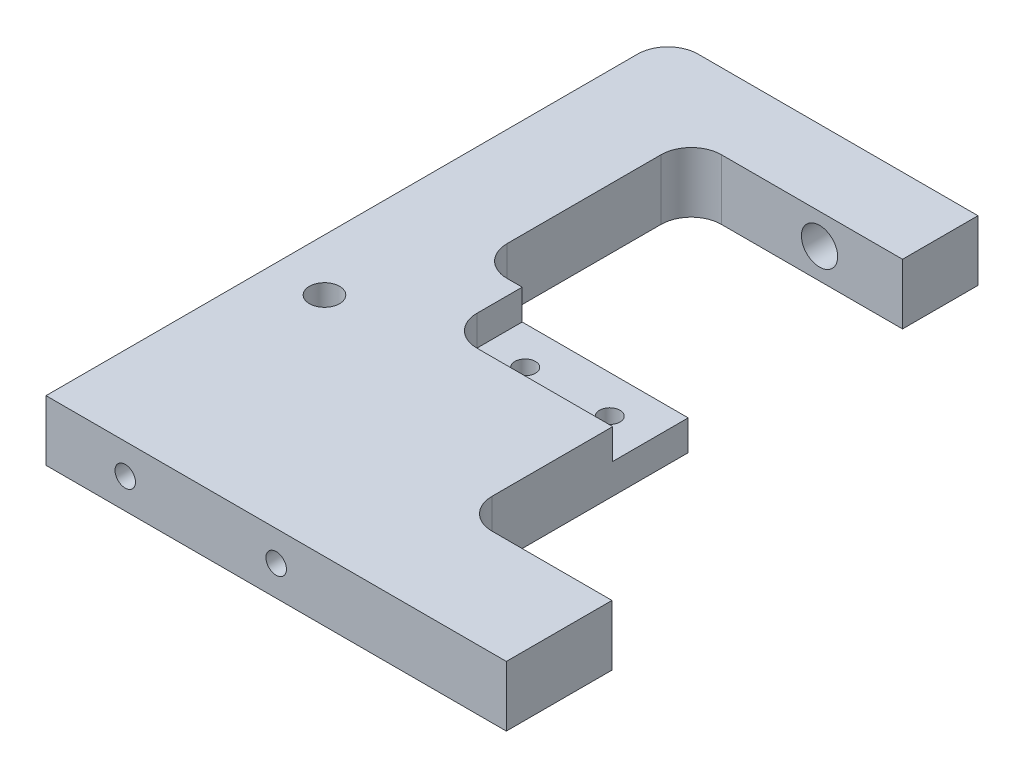
ISO-10303-21;
HEADER;
FILE_DESCRIPTION(('STEP AP214'),'2;1');
FILE_NAME('part.step','',(''),(''),'','','');
FILE_SCHEMA(('AUTOMOTIVE_DESIGN { 1 0 10303 214 1 1 1 1 }'));
ENDSEC;
DATA;
#1=APPLICATION_CONTEXT('core data for automotive mechanical design processes');
#2=APPLICATION_PROTOCOL_DEFINITION('international standard','automotive_design',2000,#1);
#3=PRODUCT_CONTEXT('',#1,'mechanical');
#4=PRODUCT('Part','Part','',(#3));
#5=PRODUCT_RELATED_PRODUCT_CATEGORY('part','',(#4));
#6=PRODUCT_DEFINITION_FORMATION('','',#4);
#7=PRODUCT_DEFINITION_CONTEXT('part definition',#1,'design');
#8=PRODUCT_DEFINITION('design','',#6,#7);
#9=PRODUCT_DEFINITION_SHAPE('','',#8);
#10=(LENGTH_UNIT() NAMED_UNIT(*) SI_UNIT(.MILLI.,.METRE.));
#11=(NAMED_UNIT(*) PLANE_ANGLE_UNIT() SI_UNIT($,.RADIAN.));
#12=(NAMED_UNIT(*) SI_UNIT($,.STERADIAN.) SOLID_ANGLE_UNIT());
#13=UNCERTAINTY_MEASURE_WITH_UNIT(LENGTH_MEASURE(1.E-05),#10,'distance_accuracy_value','');
#14=(GEOMETRIC_REPRESENTATION_CONTEXT(3) GLOBAL_UNCERTAINTY_ASSIGNED_CONTEXT((#13)) GLOBAL_UNIT_ASSIGNED_CONTEXT((#10,
#11,#12)) REPRESENTATION_CONTEXT('',''));
#15=CARTESIAN_POINT('',(0.,0.,0.));
#16=DIRECTION('',(0.,0.,1.));
#17=DIRECTION('',(1.,0.,0.));
#18=AXIS2_PLACEMENT_3D('',#15,#16,#17);
#19=CARTESIAN_POINT('',(10.0000000000001,20.,-206.));
#20=DIRECTION('',(0.,0.,1.));
#21=DIRECTION('',(1.,0.,0.));
#22=AXIS2_PLACEMENT_3D('',#19,#20,#21);
#23=PLANE('',#22);
#24=DIRECTION('',(-1.,0.,0.));
#25=VECTOR('',#24,1.);
#26=CARTESIAN_POINT('',(10.0000000000001,0.,-206.));
#27=LINE('',#26,#25);
#28=CARTESIAN_POINT('',(102.75,0.,-206.));
#29=VERTEX_POINT('',#28);
#30=CARTESIAN_POINT('',(10.0000000000001,0.,-206.));
#31=VERTEX_POINT('',#30);
#32=EDGE_CURVE('E172',#29,#31,#27,.T.);
#33=ORIENTED_EDGE('',*,*,#32,.T.);
#34=DIRECTION('',(0.,-1.,0.));
#35=VECTOR('',#34,1.);
#36=CARTESIAN_POINT('',(10.0000000000001,20.,-206.));
#37=LINE('',#36,#35);
#38=CARTESIAN_POINT('',(10.0000000000001,20.,-206.));
#39=VERTEX_POINT('',#38);
#40=EDGE_CURVE('E169',#39,#31,#37,.T.);
#41=ORIENTED_EDGE('',*,*,#40,.F.);
#42=DIRECTION('',(-1.,0.,0.));
#43=VECTOR('',#42,1.);
#44=CARTESIAN_POINT('',(10.0000000000001,20.,-206.));
#45=LINE('',#44,#43);
#46=CARTESIAN_POINT('',(102.75,20.,-206.));
#47=VERTEX_POINT('',#46);
#48=EDGE_CURVE('E155',#47,#39,#45,.T.);
#49=ORIENTED_EDGE('',*,*,#48,.F.);
#50=DIRECTION('',(0.,-1.,0.));
#51=VECTOR('',#50,1.);
#52=CARTESIAN_POINT('',(102.75,20.,-206.));
#53=LINE('',#52,#51);
#54=EDGE_CURVE('E175',#47,#29,#53,.T.);
#55=ORIENTED_EDGE('',*,*,#54,.T.);
#56=EDGE_LOOP('',(#33,#41,#49,#55));
#57=FACE_BOUND('',#56,.T.);
#58=CARTESIAN_POINT('',(75.25,10.,-206.));
#59=DIRECTION('',(0.,0.,-1.));
#60=DIRECTION('',(-1.,0.,0.));
#61=AXIS2_PLACEMENT_3D('',#58,#59,#60);
#62=CIRCLE('',#61,5.99999999999999);
#63=CARTESIAN_POINT('',(69.25,10.,-206.));
#64=VERTEX_POINT('',#63);
#65=EDGE_CURVE('E471',#64,#64,#62,.T.);
#66=ORIENTED_EDGE('',*,*,#65,.F.);
#67=EDGE_LOOP('',(#66));
#68=FACE_BOUND('',#67,.T.);
#69=ADVANCED_FACE('F40',(#57,#68),#23,.F.);
#70=CARTESIAN_POINT('',(102.75,20.,0.));
#71=DIRECTION('',(0.,0.,-1.));
#72=DIRECTION('',(-1.,0.,0.));
#73=AXIS2_PLACEMENT_3D('',#70,#71,#72);
#74=PLANE('',#73);
#75=CARTESIAN_POINT('',(26.25,10.,0.));
#76=DIRECTION('',(0.,0.,1.));
#77=DIRECTION('',(1.,0.,0.));
#78=AXIS2_PLACEMENT_3D('',#75,#76,#77);
#79=CIRCLE('',#78,3.39999999999999);
#80=CARTESIAN_POINT('',(29.65,10.,0.));
#81=VERTEX_POINT('',#80);
#82=EDGE_CURVE('E266',#81,#81,#79,.T.);
#83=ORIENTED_EDGE('',*,*,#82,.F.);
#84=EDGE_LOOP('',(#83));
#85=FACE_BOUND('',#84,.T.);
#86=CARTESIAN_POINT('',(76.25,10.,0.));
#87=DIRECTION('',(0.,0.,1.));
#88=DIRECTION('',(1.,0.,0.));
#89=AXIS2_PLACEMENT_3D('',#86,#87,#88);
#90=CIRCLE('',#89,3.39999999999999);
#91=CARTESIAN_POINT('',(79.65,10.,0.));
#92=VERTEX_POINT('',#91);
#93=EDGE_CURVE('E272',#92,#92,#90,.T.);
#94=ORIENTED_EDGE('',*,*,#93,.F.);
#95=EDGE_LOOP('',(#94));
#96=FACE_BOUND('',#95,.T.);
#97=DIRECTION('',(1.,0.,0.));
#98=VECTOR('',#97,1.);
#99=CARTESIAN_POINT('',(102.75,0.,0.));
#100=LINE('',#99,#98);
#101=CARTESIAN_POINT('',(0.,0.,0.));
#102=VERTEX_POINT('',#101);
#103=CARTESIAN_POINT('',(152.5,0.,0.));
#104=VERTEX_POINT('',#103);
#105=EDGE_CURVE('E117',#102,#104,#100,.T.);
#106=ORIENTED_EDGE('',*,*,#105,.T.);
#107=DIRECTION('',(0.,-1.,0.));
#108=VECTOR('',#107,1.);
#109=CARTESIAN_POINT('',(152.5,20.,0.));
#110=LINE('',#109,#108);
#111=CARTESIAN_POINT('',(152.5,20.,0.));
#112=VERTEX_POINT('',#111);
#113=EDGE_CURVE('E11',#112,#104,#110,.T.);
#114=ORIENTED_EDGE('',*,*,#113,.F.);
#115=DIRECTION('',(1.,0.,0.));
#116=VECTOR('',#115,1.);
#117=CARTESIAN_POINT('',(102.75,20.,0.));
#118=LINE('',#117,#116);
#119=CARTESIAN_POINT('',(0.,20.,0.));
#120=VERTEX_POINT('',#119);
#121=EDGE_CURVE('E123',#120,#112,#118,.T.);
#122=ORIENTED_EDGE('',*,*,#121,.F.);
#123=DIRECTION('',(0.,-1.,0.));
#124=VECTOR('',#123,1.);
#125=CARTESIAN_POINT('',(0.,20.,0.));
#126=LINE('',#125,#124);
#127=EDGE_CURVE('E181',#120,#102,#126,.T.);
#128=ORIENTED_EDGE('',*,*,#127,.T.);
#129=EDGE_LOOP('',(#106,#114,#122,#128));
#130=FACE_BOUND('',#129,.T.);
#131=ADVANCED_FACE('F42',(#85,#96,#130),#74,.F.);
#132=CARTESIAN_POINT('',(152.5,20.,0.));
#133=DIRECTION('',(-1.,0.,0.));
#134=DIRECTION('',(0.,0.,1.));
#135=AXIS2_PLACEMENT_3D('',#132,#133,#134);
#136=PLANE('',#135);
#137=DIRECTION('',(0.,0.,-1.));
#138=VECTOR('',#137,1.);
#139=CARTESIAN_POINT('',(152.5,0.,0.));
#140=LINE('',#139,#138);
#141=CARTESIAN_POINT('',(152.5,0.,-35.));
#142=VERTEX_POINT('',#141);
#143=EDGE_CURVE('E186',#104,#142,#140,.T.);
#144=ORIENTED_EDGE('',*,*,#143,.T.);
#145=DIRECTION('',(0.,-1.,0.));
#146=VECTOR('',#145,1.);
#147=CARTESIAN_POINT('',(152.5,20.,-35.));
#148=LINE('',#147,#146);
#149=CARTESIAN_POINT('',(152.5,20.,-35.));
#150=VERTEX_POINT('',#149);
#151=EDGE_CURVE('E49',#150,#142,#148,.T.);
#152=ORIENTED_EDGE('',*,*,#151,.F.);
#153=DIRECTION('',(0.,0.,-1.));
#154=VECTOR('',#153,1.);
#155=CARTESIAN_POINT('',(152.5,20.,0.));
#156=LINE('',#155,#154);
#157=EDGE_CURVE('E433',#112,#150,#156,.T.);
#158=ORIENTED_EDGE('',*,*,#157,.F.);
#159=ORIENTED_EDGE('',*,*,#113,.T.);
#160=EDGE_LOOP('',(#144,#152,#158,#159));
#161=FACE_BOUND('',#160,.T.);
#162=ADVANCED_FACE('F345',(#161),#136,.F.);
#163=CARTESIAN_POINT('',(152.5,20.,-35.));
#164=DIRECTION('',(0.,0.,1.));
#165=DIRECTION('',(1.,0.,0.));
#166=AXIS2_PLACEMENT_3D('',#163,#164,#165);
#167=PLANE('',#166);
#168=CARTESIAN_POINT('',(143.5,10.,-35.));
#169=DIRECTION('',(0.,0.,-1.));
#170=DIRECTION('',(-1.,0.,0.));
#171=AXIS2_PLACEMENT_3D('',#168,#169,#170);
#172=CIRCLE('',#171,2.5);
#173=CARTESIAN_POINT('',(141.,10.,-35.));
#174=VERTEX_POINT('',#173);
#175=EDGE_CURVE('E243',#174,#174,#172,.T.);
#176=ORIENTED_EDGE('',*,*,#175,.F.);
#177=EDGE_LOOP('',(#176));
#178=FACE_BOUND('',#177,.T.);
#179=CARTESIAN_POINT('',(131.,10.,-35.));
#180=DIRECTION('',(0.,0.,-1.));
#181=DIRECTION('',(-1.,0.,0.));
#182=AXIS2_PLACEMENT_3D('',#179,#180,#181);
#183=CIRCLE('',#182,2.5);
#184=CARTESIAN_POINT('',(128.5,10.,-35.));
#185=VERTEX_POINT('',#184);
#186=EDGE_CURVE('E260',#185,#185,#183,.T.);
#187=ORIENTED_EDGE('',*,*,#186,.F.);
#188=EDGE_LOOP('',(#187));
#189=FACE_BOUND('',#188,.T.);
#190=DIRECTION('',(-1.,0.,0.));
#191=VECTOR('',#190,1.);
#192=CARTESIAN_POINT('',(152.5,0.,-35.));
#193=LINE('',#192,#191);
#194=CARTESIAN_POINT('',(112.75,0.,-35.));
#195=VERTEX_POINT('',#194);
#196=EDGE_CURVE('E189',#142,#195,#193,.T.);
#197=ORIENTED_EDGE('',*,*,#196,.T.);
#198=DIRECTION('',(0.,-1.,0.));
#199=VECTOR('',#198,1.);
#200=CARTESIAN_POINT('',(112.75,20.,-35.));
#201=LINE('',#200,#199);
#202=CARTESIAN_POINT('',(112.75,20.,-35.));
#203=VERTEX_POINT('',#202);
#204=EDGE_CURVE('E237',#203,#195,#201,.T.);
#205=ORIENTED_EDGE('',*,*,#204,.F.);
#206=DIRECTION('',(-1.,0.,0.));
#207=VECTOR('',#206,1.);
#208=CARTESIAN_POINT('',(152.5,20.,-35.));
#209=LINE('',#208,#207);
#210=EDGE_CURVE('E395',#150,#203,#209,.T.);
#211=ORIENTED_EDGE('',*,*,#210,.F.);
#212=ORIENTED_EDGE('',*,*,#151,.T.);
#213=EDGE_LOOP('',(#197,#205,#211,#212));
#214=FACE_BOUND('',#213,.T.);
#215=ADVANCED_FACE('F381',(#178,#189,#214),#167,.F.);
#216=CARTESIAN_POINT('',(112.75,20.,-45.));
#217=DIRECTION('',(0.,-1.,0.));
#218=DIRECTION('',(0.,0.,-1.));
#219=AXIS2_PLACEMENT_3D('',#216,#217,#218);
#220=CYLINDRICAL_SURFACE('',#219,10.);
#221=CARTESIAN_POINT('',(112.75,0.,-45.));
#222=DIRECTION('',(0.,-1.,0.));
#223=DIRECTION('',(0.,0.,-1.));
#224=AXIS2_PLACEMENT_3D('',#221,#222,#223);
#225=CIRCLE('',#224,10.);
#226=CARTESIAN_POINT('',(102.75,0.,-45.0000000000001));
#227=VERTEX_POINT('',#226);
#228=EDGE_CURVE('E191',#195,#227,#225,.T.);
#229=ORIENTED_EDGE('',*,*,#228,.T.);
#230=DIRECTION('',(0.,-1.,0.));
#231=VECTOR('',#230,1.);
#232=CARTESIAN_POINT('',(102.75,20.,-45.0000000000001));
#233=LINE('',#232,#231);
#234=CARTESIAN_POINT('',(102.75,20.,-45.0000000000001));
#235=VERTEX_POINT('',#234);
#236=EDGE_CURVE('E234',#235,#227,#233,.T.);
#237=ORIENTED_EDGE('',*,*,#236,.F.);
#238=CARTESIAN_POINT('',(112.75,20.,-45.));
#239=DIRECTION('',(0.,-1.,0.));
#240=DIRECTION('',(0.,0.,-1.));
#241=AXIS2_PLACEMENT_3D('',#238,#239,#240);
#242=CIRCLE('',#241,10.);
#243=EDGE_CURVE('E410',#203,#235,#242,.T.);
#244=ORIENTED_EDGE('',*,*,#243,.F.);
#245=ORIENTED_EDGE('',*,*,#204,.T.);
#246=EDGE_LOOP('',(#229,#237,#244,#245));
#247=FACE_BOUND('',#246,.T.);
#248=ADVANCED_FACE('F377',(#247),#220,.F.);
#249=CARTESIAN_POINT('',(102.75,20.,-110.));
#250=DIRECTION('',(-1.,0.,0.));
#251=DIRECTION('',(0.,0.,1.));
#252=AXIS2_PLACEMENT_3D('',#249,#250,#251);
#253=PLANE('',#252);
#254=DIRECTION('',(0.,0.,-1.));
#255=VECTOR('',#254,1.);
#256=CARTESIAN_POINT('',(102.75,10.,-110.));
#257=LINE('',#256,#255);
#258=CARTESIAN_POINT('',(102.75,10.,-85.));
#259=VERTEX_POINT('',#258);
#260=CARTESIAN_POINT('',(102.75,10.,-110.));
#261=VERTEX_POINT('',#260);
#262=EDGE_CURVE('E439',#259,#261,#257,.T.);
#263=ORIENTED_EDGE('',*,*,#262,.F.);
#264=DIRECTION('',(0.,1.,0.));
#265=VECTOR('',#264,1.);
#266=CARTESIAN_POINT('',(102.75,10.,-85.));
#267=LINE('',#266,#265);
#268=CARTESIAN_POINT('',(102.75,20.,-85.));
#269=VERTEX_POINT('',#268);
#270=EDGE_CURVE('E187',#259,#269,#267,.T.);
#271=ORIENTED_EDGE('',*,*,#270,.T.);
#272=DIRECTION('',(0.,0.,-1.));
#273=VECTOR('',#272,1.);
#274=CARTESIAN_POINT('',(102.75,20.,-110.));
#275=LINE('',#274,#273);
#276=EDGE_CURVE('E407',#235,#269,#275,.T.);
#277=ORIENTED_EDGE('',*,*,#276,.F.);
#278=ORIENTED_EDGE('',*,*,#236,.T.);
#279=DIRECTION('',(0.,0.,-1.));
#280=VECTOR('',#279,1.);
#281=CARTESIAN_POINT('',(102.75,0.,-110.));
#282=LINE('',#281,#280);
#283=CARTESIAN_POINT('',(102.75,0.,-110.));
#284=VERTEX_POINT('',#283);
#285=EDGE_CURVE('E193',#227,#284,#282,.T.);
#286=ORIENTED_EDGE('',*,*,#285,.T.);
#287=DIRECTION('',(0.,-1.,0.));
#288=VECTOR('',#287,1.);
#289=CARTESIAN_POINT('',(102.75,20.,-110.));
#290=LINE('',#289,#288);
#291=EDGE_CURVE('E232',#261,#284,#290,.T.);
#292=ORIENTED_EDGE('',*,*,#291,.F.);
#293=EDGE_LOOP('',(#263,#271,#277,#278,#286,#292));
#294=FACE_BOUND('',#293,.T.);
#295=ADVANCED_FACE('F373',(#294),#253,.F.);
#296=CARTESIAN_POINT('',(42.7500000000001,20.,-110.));
#297=DIRECTION('',(0.,0.,1.));
#298=DIRECTION('',(1.,0.,0.));
#299=AXIS2_PLACEMENT_3D('',#296,#297,#298);
#300=PLANE('',#299);
#301=DIRECTION('',(-1.,0.,0.));
#302=VECTOR('',#301,1.);
#303=CARTESIAN_POINT('',(42.7500000000001,20.,-110.));
#304=LINE('',#303,#302);
#305=CARTESIAN_POINT('',(47.75,20.,-110.));
#306=VERTEX_POINT('',#305);
#307=CARTESIAN_POINT('',(42.7500000000001,20.,-110.));
#308=VERTEX_POINT('',#307);
#309=EDGE_CURVE('E409',#306,#308,#304,.T.);
#310=ORIENTED_EDGE('',*,*,#309,.F.);
#311=DIRECTION('',(0.,1.,0.));
#312=VECTOR('',#311,1.);
#313=CARTESIAN_POINT('',(47.75,10.,-110.));
#314=LINE('',#313,#312);
#315=CARTESIAN_POINT('',(47.75,10.,-110.));
#316=VERTEX_POINT('',#315);
#317=EDGE_CURVE('E57',#316,#306,#314,.T.);
#318=ORIENTED_EDGE('',*,*,#317,.F.);
#319=DIRECTION('',(-1.,0.,0.));
#320=VECTOR('',#319,1.);
#321=CARTESIAN_POINT('',(47.75,10.,-110.));
#322=LINE('',#321,#320);
#323=EDGE_CURVE('E449',#261,#316,#322,.T.);
#324=ORIENTED_EDGE('',*,*,#323,.F.);
#325=ORIENTED_EDGE('',*,*,#291,.T.);
#326=DIRECTION('',(-1.,0.,0.));
#327=VECTOR('',#326,1.);
#328=CARTESIAN_POINT('',(42.7500000000001,0.,-110.));
#329=LINE('',#328,#327);
#330=CARTESIAN_POINT('',(42.7500000000001,0.,-110.));
#331=VERTEX_POINT('',#330);
#332=EDGE_CURVE('E196',#284,#331,#329,.T.);
#333=ORIENTED_EDGE('',*,*,#332,.T.);
#334=DIRECTION('',(0.,-1.,0.));
#335=VECTOR('',#334,1.);
#336=CARTESIAN_POINT('',(42.7500000000001,20.,-110.));
#337=LINE('',#336,#335);
#338=EDGE_CURVE('E229',#308,#331,#337,.T.);
#339=ORIENTED_EDGE('',*,*,#338,.F.);
#340=EDGE_LOOP('',(#310,#318,#324,#325,#333,#339));
#341=FACE_BOUND('',#340,.T.);
#342=ADVANCED_FACE('F369',(#341),#300,.F.);
#343=CARTESIAN_POINT('',(42.75,20.,-120.));
#344=DIRECTION('',(0.,-1.,0.));
#345=DIRECTION('',(0.,0.,-1.));
#346=AXIS2_PLACEMENT_3D('',#343,#344,#345);
#347=CYLINDRICAL_SURFACE('',#346,10.);
#348=CARTESIAN_POINT('',(42.75,0.,-120.));
#349=DIRECTION('',(0.,-1.,0.));
#350=DIRECTION('',(0.,0.,1.));
#351=AXIS2_PLACEMENT_3D('',#348,#349,#350);
#352=CIRCLE('',#351,10.);
#353=CARTESIAN_POINT('',(32.75,0.,-120.));
#354=VERTEX_POINT('',#353);
#355=EDGE_CURVE('E198',#331,#354,#352,.T.);
#356=ORIENTED_EDGE('',*,*,#355,.T.);
#357=DIRECTION('',(0.,-1.,0.));
#358=VECTOR('',#357,1.);
#359=CARTESIAN_POINT('',(32.75,20.,-120.));
#360=LINE('',#359,#358);
#361=CARTESIAN_POINT('',(32.75,20.,-120.));
#362=VERTEX_POINT('',#361);
#363=EDGE_CURVE('E226',#362,#354,#360,.T.);
#364=ORIENTED_EDGE('',*,*,#363,.F.);
#365=CARTESIAN_POINT('',(42.75,20.,-120.));
#366=DIRECTION('',(0.,-1.,0.));
#367=DIRECTION('',(0.,0.,1.));
#368=AXIS2_PLACEMENT_3D('',#365,#366,#367);
#369=CIRCLE('',#368,10.);
#370=EDGE_CURVE('E412',#308,#362,#369,.T.);
#371=ORIENTED_EDGE('',*,*,#370,.F.);
#372=ORIENTED_EDGE('',*,*,#338,.T.);
#373=EDGE_LOOP('',(#356,#364,#371,#372));
#374=FACE_BOUND('',#373,.T.);
#375=ADVANCED_FACE('F365',(#374),#347,.F.);
#376=CARTESIAN_POINT('',(32.75,20.,-171.));
#377=DIRECTION('',(-1.,0.,0.));
#378=DIRECTION('',(0.,0.,1.));
#379=AXIS2_PLACEMENT_3D('',#376,#377,#378);
#380=PLANE('',#379);
#381=DIRECTION('',(0.,0.,-1.));
#382=VECTOR('',#381,1.);
#383=CARTESIAN_POINT('',(32.75,0.,-171.));
#384=LINE('',#383,#382);
#385=CARTESIAN_POINT('',(32.75,0.,-171.));
#386=VERTEX_POINT('',#385);
#387=EDGE_CURVE('E200',#354,#386,#384,.T.);
#388=ORIENTED_EDGE('',*,*,#387,.T.);
#389=DIRECTION('',(0.,-1.,0.));
#390=VECTOR('',#389,1.);
#391=CARTESIAN_POINT('',(32.75,20.,-171.));
#392=LINE('',#391,#390);
#393=CARTESIAN_POINT('',(32.75,20.,-171.));
#394=VERTEX_POINT('',#393);
#395=EDGE_CURVE('E223',#394,#386,#392,.T.);
#396=ORIENTED_EDGE('',*,*,#395,.F.);
#397=DIRECTION('',(0.,0.,-1.));
#398=VECTOR('',#397,1.);
#399=CARTESIAN_POINT('',(32.75,20.,-171.));
#400=LINE('',#399,#398);
#401=EDGE_CURVE('E418',#362,#394,#400,.T.);
#402=ORIENTED_EDGE('',*,*,#401,.F.);
#403=ORIENTED_EDGE('',*,*,#363,.T.);
#404=EDGE_LOOP('',(#388,#396,#402,#403));
#405=FACE_BOUND('',#404,.T.);
#406=ADVANCED_FACE('F361',(#405),#380,.F.);
#407=CARTESIAN_POINT('',(42.75,20.,-171.));
#408=DIRECTION('',(0.,-1.,0.));
#409=DIRECTION('',(0.,0.,-1.));
#410=AXIS2_PLACEMENT_3D('',#407,#408,#409);
#411=CYLINDRICAL_SURFACE('',#410,10.);
#412=CARTESIAN_POINT('',(42.75,0.,-171.));
#413=DIRECTION('',(0.,-1.,0.));
#414=DIRECTION('',(0.,0.,1.));
#415=AXIS2_PLACEMENT_3D('',#412,#413,#414);
#416=CIRCLE('',#415,10.);
#417=CARTESIAN_POINT('',(42.75,0.,-181.));
#418=VERTEX_POINT('',#417);
#419=EDGE_CURVE('E202',#386,#418,#416,.T.);
#420=ORIENTED_EDGE('',*,*,#419,.T.);
#421=DIRECTION('',(0.,-1.,0.));
#422=VECTOR('',#421,1.);
#423=CARTESIAN_POINT('',(42.75,20.,-181.));
#424=LINE('',#423,#422);
#425=CARTESIAN_POINT('',(42.75,20.,-181.));
#426=VERTEX_POINT('',#425);
#427=EDGE_CURVE('E220',#426,#418,#424,.T.);
#428=ORIENTED_EDGE('',*,*,#427,.F.);
#429=CARTESIAN_POINT('',(42.75,20.,-171.));
#430=DIRECTION('',(0.,-1.,0.));
#431=DIRECTION('',(0.,0.,1.));
#432=AXIS2_PLACEMENT_3D('',#429,#430,#431);
#433=CIRCLE('',#432,10.);
#434=EDGE_CURVE('E420',#394,#426,#433,.T.);
#435=ORIENTED_EDGE('',*,*,#434,.F.);
#436=ORIENTED_EDGE('',*,*,#395,.T.);
#437=EDGE_LOOP('',(#420,#428,#435,#436));
#438=FACE_BOUND('',#437,.T.);
#439=ADVANCED_FACE('F357',(#438),#411,.F.);
#440=CARTESIAN_POINT('',(102.75,20.,-181.));
#441=DIRECTION('',(0.,0.,-1.));
#442=DIRECTION('',(-1.,0.,0.));
#443=AXIS2_PLACEMENT_3D('',#440,#441,#442);
#444=PLANE('',#443);
#445=CARTESIAN_POINT('',(75.25,10.,-181.));
#446=DIRECTION('',(0.,0.,-1.));
#447=DIRECTION('',(-1.,0.,0.));
#448=AXIS2_PLACEMENT_3D('',#445,#446,#447);
#449=CIRCLE('',#448,5.99999999999999);
#450=CARTESIAN_POINT('',(69.25,10.,-181.));
#451=VERTEX_POINT('',#450);
#452=EDGE_CURVE('E455',#451,#451,#449,.T.);
#453=ORIENTED_EDGE('',*,*,#452,.T.);
#454=EDGE_LOOP('',(#453));
#455=FACE_BOUND('',#454,.T.);
#456=DIRECTION('',(1.,0.,0.));
#457=VECTOR('',#456,1.);
#458=CARTESIAN_POINT('',(102.75,0.,-181.));
#459=LINE('',#458,#457);
#460=CARTESIAN_POINT('',(102.75,0.,-181.));
#461=VERTEX_POINT('',#460);
#462=EDGE_CURVE('E204',#418,#461,#459,.T.);
#463=ORIENTED_EDGE('',*,*,#462,.T.);
#464=DIRECTION('',(0.,-1.,0.));
#465=VECTOR('',#464,1.);
#466=CARTESIAN_POINT('',(102.75,20.,-181.));
#467=LINE('',#466,#465);
#468=CARTESIAN_POINT('',(102.75,20.,-181.));
#469=VERTEX_POINT('',#468);
#470=EDGE_CURVE('E217',#469,#461,#467,.T.);
#471=ORIENTED_EDGE('',*,*,#470,.F.);
#472=DIRECTION('',(1.,0.,0.));
#473=VECTOR('',#472,1.);
#474=CARTESIAN_POINT('',(102.75,20.,-181.));
#475=LINE('',#474,#473);
#476=EDGE_CURVE('E422',#426,#469,#475,.T.);
#477=ORIENTED_EDGE('',*,*,#476,.F.);
#478=ORIENTED_EDGE('',*,*,#427,.T.);
#479=EDGE_LOOP('',(#463,#471,#477,#478));
#480=FACE_BOUND('',#479,.T.);
#481=ADVANCED_FACE('F353',(#455,#480),#444,.F.);
#482=CARTESIAN_POINT('',(102.75,20.,-206.));
#483=DIRECTION('',(-1.,0.,0.));
#484=DIRECTION('',(0.,0.,1.));
#485=AXIS2_PLACEMENT_3D('',#482,#483,#484);
#486=PLANE('',#485);
#487=DIRECTION('',(0.,0.,-1.));
#488=VECTOR('',#487,1.);
#489=CARTESIAN_POINT('',(102.75,0.,-206.));
#490=LINE('',#489,#488);
#491=EDGE_CURVE('E206',#461,#29,#490,.T.);
#492=ORIENTED_EDGE('',*,*,#491,.T.);
#493=ORIENTED_EDGE('',*,*,#54,.F.);
#494=DIRECTION('',(0.,0.,-1.));
#495=VECTOR('',#494,1.);
#496=CARTESIAN_POINT('',(102.75,20.,-206.));
#497=LINE('',#496,#495);
#498=EDGE_CURVE('E163',#469,#47,#497,.T.);
#499=ORIENTED_EDGE('',*,*,#498,.F.);
#500=ORIENTED_EDGE('',*,*,#470,.T.);
#501=EDGE_LOOP('',(#492,#493,#499,#500));
#502=FACE_BOUND('',#501,.T.);
#503=ADVANCED_FACE('F350',(#502),#486,.F.);
#504=CARTESIAN_POINT('',(10.,20.,-196.));
#505=DIRECTION('',(0.,-1.,0.));
#506=DIRECTION('',(0.,0.,-1.));
#507=AXIS2_PLACEMENT_3D('',#504,#505,#506);
#508=CYLINDRICAL_SURFACE('',#507,10.);
#509=CARTESIAN_POINT('',(10.,0.,-196.));
#510=DIRECTION('',(0.,1.,0.));
#511=DIRECTION('',(0.,0.,1.));
#512=AXIS2_PLACEMENT_3D('',#509,#510,#511);
#513=CIRCLE('',#512,10.);
#514=CARTESIAN_POINT('',(0.,0.,-196.));
#515=VERTEX_POINT('',#514);
#516=EDGE_CURVE('E209',#31,#515,#513,.T.);
#517=ORIENTED_EDGE('',*,*,#516,.T.);
#518=DIRECTION('',(0.,-1.,0.));
#519=VECTOR('',#518,1.);
#520=CARTESIAN_POINT('',(0.,20.,-196.));
#521=LINE('',#520,#519);
#522=CARTESIAN_POINT('',(0.,20.,-196.));
#523=VERTEX_POINT('',#522);
#524=EDGE_CURVE('E176',#523,#515,#521,.T.);
#525=ORIENTED_EDGE('',*,*,#524,.F.);
#526=CARTESIAN_POINT('',(10.,20.,-196.));
#527=DIRECTION('',(0.,1.,0.));
#528=DIRECTION('',(0.,0.,1.));
#529=AXIS2_PLACEMENT_3D('',#526,#527,#528);
#530=CIRCLE('',#529,10.);
#531=EDGE_CURVE('E160',#39,#523,#530,.T.);
#532=ORIENTED_EDGE('',*,*,#531,.F.);
#533=ORIENTED_EDGE('',*,*,#40,.T.);
#534=EDGE_LOOP('',(#517,#525,#532,#533));
#535=FACE_BOUND('',#534,.T.);
#536=ADVANCED_FACE('F178',(#535),#508,.T.);
#537=CARTESIAN_POINT('',(0.,20.,0.));
#538=DIRECTION('',(1.,0.,0.));
#539=DIRECTION('',(0.,0.,-1.));
#540=AXIS2_PLACEMENT_3D('',#537,#538,#539);
#541=PLANE('',#540);
#542=CARTESIAN_POINT('',(0.,9.99999999999999,-75.));
#543=DIRECTION('',(-1.,0.,0.));
#544=DIRECTION('',(0.,0.,1.));
#545=AXIS2_PLACEMENT_3D('',#542,#543,#544);
#546=CIRCLE('',#545,2.49999999999999);
#547=CARTESIAN_POINT('',(0.,9.99999999999999,-72.5));
#548=VERTEX_POINT('',#547);
#549=EDGE_CURVE('E278',#548,#548,#546,.T.);
#550=ORIENTED_EDGE('',*,*,#549,.F.);
#551=EDGE_LOOP('',(#550));
#552=FACE_BOUND('',#551,.T.);
#553=DIRECTION('',(0.,0.,1.));
#554=VECTOR('',#553,1.);
#555=CARTESIAN_POINT('',(0.,0.,0.));
#556=LINE('',#555,#554);
#557=EDGE_CURVE('E211',#515,#102,#556,.T.);
#558=ORIENTED_EDGE('',*,*,#557,.T.);
#559=ORIENTED_EDGE('',*,*,#127,.F.);
#560=DIRECTION('',(0.,0.,1.));
#561=VECTOR('',#560,1.);
#562=CARTESIAN_POINT('',(0.,20.,0.));
#563=LINE('',#562,#561);
#564=EDGE_CURVE('E66',#523,#120,#563,.T.);
#565=ORIENTED_EDGE('',*,*,#564,.F.);
#566=ORIENTED_EDGE('',*,*,#524,.T.);
#567=EDGE_LOOP('',(#558,#559,#565,#566));
#568=FACE_BOUND('',#567,.T.);
#569=ADVANCED_FACE('F431',(#552,#568),#541,.F.);
#570=CARTESIAN_POINT('',(10.,20.,-196.));
#571=DIRECTION('',(0.,1.,0.));
#572=DIRECTION('',(0.,0.,1.));
#573=AXIS2_PLACEMENT_3D('',#570,#571,#572);
#574=PLANE('',#573);
#575=CARTESIAN_POINT('',(17.2499999999999,20.,-75.));
#576=DIRECTION('',(0.,1.,0.));
#577=DIRECTION('',(0.,0.,1.));
#578=AXIS2_PLACEMENT_3D('',#575,#576,#577);
#579=CIRCLE('',#578,4.99999999999999);
#580=CARTESIAN_POINT('',(17.2499999999999,20.,-70.));
#581=VERTEX_POINT('',#580);
#582=EDGE_CURVE('E288',#581,#581,#579,.T.);
#583=ORIENTED_EDGE('',*,*,#582,.F.);
#584=EDGE_LOOP('',(#583));
#585=FACE_BOUND('',#584,.T.);
#586=DIRECTION('',(1.,0.,0.));
#587=VECTOR('',#586,1.);
#588=CARTESIAN_POINT('',(57.75,20.,-85.));
#589=LINE('',#588,#587);
#590=CARTESIAN_POINT('',(57.75,20.,-85.));
#591=VERTEX_POINT('',#590);
#592=EDGE_CURVE('E446',#591,#269,#589,.T.);
#593=ORIENTED_EDGE('',*,*,#592,.F.);
#594=CARTESIAN_POINT('',(57.75,20.,-95.));
#595=DIRECTION('',(0.,1.,0.));
#596=DIRECTION('',(0.,0.,1.));
#597=AXIS2_PLACEMENT_3D('',#594,#595,#596);
#598=CIRCLE('',#597,10.);
#599=CARTESIAN_POINT('',(47.75,20.,-95.));
#600=VERTEX_POINT('',#599);
#601=EDGE_CURVE('E450',#600,#591,#598,.T.);
#602=ORIENTED_EDGE('',*,*,#601,.F.);
#603=DIRECTION('',(0.,0.,1.));
#604=VECTOR('',#603,1.);
#605=CARTESIAN_POINT('',(47.75,20.,-110.));
#606=LINE('',#605,#604);
#607=EDGE_CURVE('E453',#306,#600,#606,.T.);
#608=ORIENTED_EDGE('',*,*,#607,.F.);
#609=ORIENTED_EDGE('',*,*,#309,.T.);
#610=ORIENTED_EDGE('',*,*,#370,.T.);
#611=ORIENTED_EDGE('',*,*,#401,.T.);
#612=ORIENTED_EDGE('',*,*,#434,.T.);
#613=ORIENTED_EDGE('',*,*,#476,.T.);
#614=ORIENTED_EDGE('',*,*,#498,.T.);
#615=ORIENTED_EDGE('',*,*,#48,.T.);
#616=ORIENTED_EDGE('',*,*,#531,.T.);
#617=ORIENTED_EDGE('',*,*,#564,.T.);
#618=ORIENTED_EDGE('',*,*,#121,.T.);
#619=ORIENTED_EDGE('',*,*,#157,.T.);
#620=ORIENTED_EDGE('',*,*,#210,.T.);
#621=ORIENTED_EDGE('',*,*,#243,.T.);
#622=ORIENTED_EDGE('',*,*,#276,.T.);
#623=EDGE_LOOP('',(#593,#602,#608,#609,#610,#611,#612,#613,#614,#615,#616,#617,#618,#619,#620,
#621,#622));
#624=FACE_BOUND('',#623,.T.);
#625=ADVANCED_FACE('F158',(#585,#624),#574,.T.);
#626=CARTESIAN_POINT('',(10.,0.,-196.));
#627=DIRECTION('',(0.,1.,0.));
#628=DIRECTION('',(0.,0.,1.));
#629=AXIS2_PLACEMENT_3D('',#626,#627,#628);
#630=PLANE('',#629);
#631=CARTESIAN_POINT('',(61.25,0.,-97.5));
#632=DIRECTION('',(0.,1.,0.));
#633=DIRECTION('',(0.,0.,1.));
#634=AXIS2_PLACEMENT_3D('',#631,#632,#633);
#635=CIRCLE('',#634,3.39999999999999);
#636=CARTESIAN_POINT('',(61.25,0.,-94.1));
#637=VERTEX_POINT('',#636);
#638=EDGE_CURVE('E44',#637,#637,#635,.T.);
#639=ORIENTED_EDGE('',*,*,#638,.T.);
#640=EDGE_LOOP('',(#639));
#641=FACE_BOUND('',#640,.T.);
#642=CARTESIAN_POINT('',(89.25,0.,-97.5));
#643=DIRECTION('',(0.,1.,0.));
#644=DIRECTION('',(0.,0.,1.));
#645=AXIS2_PLACEMENT_3D('',#642,#643,#644);
#646=CIRCLE('',#645,3.4);
#647=CARTESIAN_POINT('',(89.25,0.,-94.1));
#648=VERTEX_POINT('',#647);
#649=EDGE_CURVE('E241',#648,#648,#646,.T.);
#650=ORIENTED_EDGE('',*,*,#649,.T.);
#651=EDGE_LOOP('',(#650));
#652=FACE_BOUND('',#651,.T.);
#653=CARTESIAN_POINT('',(17.2499999999999,0.,-75.));
#654=DIRECTION('',(0.,1.,0.));
#655=DIRECTION('',(0.,0.,1.));
#656=AXIS2_PLACEMENT_3D('',#653,#654,#655);
#657=CIRCLE('',#656,4.99999999999999);
#658=CARTESIAN_POINT('',(17.2499999999999,0.,-70.));
#659=VERTEX_POINT('',#658);
#660=EDGE_CURVE('E473',#659,#659,#657,.T.);
#661=ORIENTED_EDGE('',*,*,#660,.T.);
#662=EDGE_LOOP('',(#661));
#663=FACE_BOUND('',#662,.T.);
#664=ORIENTED_EDGE('',*,*,#105,.F.);
#665=ORIENTED_EDGE('',*,*,#557,.F.);
#666=ORIENTED_EDGE('',*,*,#516,.F.);
#667=ORIENTED_EDGE('',*,*,#32,.F.);
#668=ORIENTED_EDGE('',*,*,#491,.F.);
#669=ORIENTED_EDGE('',*,*,#462,.F.);
#670=ORIENTED_EDGE('',*,*,#419,.F.);
#671=ORIENTED_EDGE('',*,*,#387,.F.);
#672=ORIENTED_EDGE('',*,*,#355,.F.);
#673=ORIENTED_EDGE('',*,*,#332,.F.);
#674=ORIENTED_EDGE('',*,*,#285,.F.);
#675=ORIENTED_EDGE('',*,*,#228,.F.);
#676=ORIENTED_EDGE('',*,*,#196,.F.);
#677=ORIENTED_EDGE('',*,*,#143,.F.);
#678=EDGE_LOOP('',(#664,#665,#666,#667,#668,#669,#670,#671,#672,#673,#674,#675,#676,#677));
#679=FACE_BOUND('',#678,.T.);
#680=ADVANCED_FACE('F397',(#641,#652,#663,#679),#630,.F.);
#681=CARTESIAN_POINT('',(57.75,10.,-85.));
#682=DIRECTION('',(0.,0.,1.));
#683=DIRECTION('',(1.,0.,0.));
#684=AXIS2_PLACEMENT_3D('',#681,#682,#683);
#685=PLANE('',#684);
#686=ORIENTED_EDGE('',*,*,#592,.T.);
#687=ORIENTED_EDGE('',*,*,#270,.F.);
#688=DIRECTION('',(1.,0.,0.));
#689=VECTOR('',#688,1.);
#690=CARTESIAN_POINT('',(57.75,10.,-85.));
#691=LINE('',#690,#689);
#692=CARTESIAN_POINT('',(57.75,10.,-85.));
#693=VERTEX_POINT('',#692);
#694=EDGE_CURVE('E458',#693,#259,#691,.T.);
#695=ORIENTED_EDGE('',*,*,#694,.F.);
#696=DIRECTION('',(0.,1.,0.));
#697=VECTOR('',#696,1.);
#698=CARTESIAN_POINT('',(57.75,10.,-85.));
#699=LINE('',#698,#697);
#700=EDGE_CURVE('E442',#693,#591,#699,.T.);
#701=ORIENTED_EDGE('',*,*,#700,.T.);
#702=EDGE_LOOP('',(#686,#687,#695,#701));
#703=FACE_BOUND('',#702,.T.);
#704=ADVANCED_FACE('F487',(#703),#685,.F.);
#705=CARTESIAN_POINT('',(57.75,10.,-95.));
#706=DIRECTION('',(0.,1.,0.));
#707=DIRECTION('',(0.,0.,1.));
#708=AXIS2_PLACEMENT_3D('',#705,#706,#707);
#709=CYLINDRICAL_SURFACE('',#708,10.);
#710=ORIENTED_EDGE('',*,*,#601,.T.);
#711=ORIENTED_EDGE('',*,*,#700,.F.);
#712=CARTESIAN_POINT('',(57.75,10.,-95.));
#713=DIRECTION('',(0.,1.,0.));
#714=DIRECTION('',(0.,0.,1.));
#715=AXIS2_PLACEMENT_3D('',#712,#713,#714);
#716=CIRCLE('',#715,10.);
#717=CARTESIAN_POINT('',(47.75,10.,-95.));
#718=VERTEX_POINT('',#717);
#719=EDGE_CURVE('E461',#718,#693,#716,.T.);
#720=ORIENTED_EDGE('',*,*,#719,.F.);
#721=DIRECTION('',(0.,1.,0.));
#722=VECTOR('',#721,1.);
#723=CARTESIAN_POINT('',(47.75,10.,-95.));
#724=LINE('',#723,#722);
#725=EDGE_CURVE('E438',#718,#600,#724,.T.);
#726=ORIENTED_EDGE('',*,*,#725,.T.);
#727=EDGE_LOOP('',(#710,#711,#720,#726));
#728=FACE_BOUND('',#727,.T.);
#729=ADVANCED_FACE('F496',(#728),#709,.F.);
#730=CARTESIAN_POINT('',(47.75,10.,-110.));
#731=DIRECTION('',(-1.,0.,0.));
#732=DIRECTION('',(0.,0.,1.));
#733=AXIS2_PLACEMENT_3D('',#730,#731,#732);
#734=PLANE('',#733);
#735=ORIENTED_EDGE('',*,*,#607,.T.);
#736=ORIENTED_EDGE('',*,*,#725,.F.);
#737=DIRECTION('',(0.,0.,1.));
#738=VECTOR('',#737,1.);
#739=CARTESIAN_POINT('',(47.75,10.,-110.));
#740=LINE('',#739,#738);
#741=EDGE_CURVE('E464',#316,#718,#740,.T.);
#742=ORIENTED_EDGE('',*,*,#741,.F.);
#743=ORIENTED_EDGE('',*,*,#317,.T.);
#744=EDGE_LOOP('',(#735,#736,#742,#743));
#745=FACE_BOUND('',#744,.T.);
#746=ADVANCED_FACE('F492',(#745),#734,.F.);
#747=CARTESIAN_POINT('',(57.75,10.,-95.));
#748=DIRECTION('',(0.,1.,0.));
#749=DIRECTION('',(0.,0.,1.));
#750=AXIS2_PLACEMENT_3D('',#747,#748,#749);
#751=PLANE('',#750);
#752=CARTESIAN_POINT('',(61.25,10.,-97.5));
#753=DIRECTION('',(0.,1.,0.));
#754=DIRECTION('',(0.,0.,1.));
#755=AXIS2_PLACEMENT_3D('',#752,#753,#754);
#756=CIRCLE('',#755,3.39999999999999);
#757=CARTESIAN_POINT('',(61.25,10.,-94.1));
#758=VERTEX_POINT('',#757);
#759=EDGE_CURVE('E255',#758,#758,#756,.T.);
#760=ORIENTED_EDGE('',*,*,#759,.F.);
#761=EDGE_LOOP('',(#760));
#762=FACE_BOUND('',#761,.T.);
#763=CARTESIAN_POINT('',(89.25,10.,-97.5));
#764=DIRECTION('',(0.,1.,0.));
#765=DIRECTION('',(0.,0.,1.));
#766=AXIS2_PLACEMENT_3D('',#763,#764,#765);
#767=CIRCLE('',#766,3.4);
#768=CARTESIAN_POINT('',(89.25,10.,-94.1));
#769=VERTEX_POINT('',#768);
#770=EDGE_CURVE('E244',#769,#769,#767,.T.);
#771=ORIENTED_EDGE('',*,*,#770,.F.);
#772=EDGE_LOOP('',(#771));
#773=FACE_BOUND('',#772,.T.);
#774=ORIENTED_EDGE('',*,*,#323,.T.);
#775=ORIENTED_EDGE('',*,*,#741,.T.);
#776=ORIENTED_EDGE('',*,*,#719,.T.);
#777=ORIENTED_EDGE('',*,*,#694,.T.);
#778=ORIENTED_EDGE('',*,*,#262,.T.);
#779=EDGE_LOOP('',(#774,#775,#776,#777,#778));
#780=FACE_BOUND('',#779,.T.);
#781=ADVANCED_FACE('F495',(#762,#773,#780),#751,.T.);
#782=CARTESIAN_POINT('',(75.25,10.,-206.));
#783=DIRECTION('',(0.,0.,-1.));
#784=DIRECTION('',(-1.,0.,0.));
#785=AXIS2_PLACEMENT_3D('',#782,#783,#784);
#786=CYLINDRICAL_SURFACE('',#785,5.99999999999999);
#787=ORIENTED_EDGE('',*,*,#452,.F.);
#788=EDGE_LOOP('',(#787));
#789=FACE_BOUND('',#788,.T.);
#790=ORIENTED_EDGE('',*,*,#65,.T.);
#791=EDGE_LOOP('',(#790));
#792=FACE_BOUND('',#791,.T.);
#793=ADVANCED_FACE('F505',(#789,#792),#786,.F.);
#794=CARTESIAN_POINT('',(17.2499999999999,20.,-75.));
#795=DIRECTION('',(0.,1.,0.));
#796=DIRECTION('',(0.,0.,1.));
#797=AXIS2_PLACEMENT_3D('',#794,#795,#796);
#798=CYLINDRICAL_SURFACE('',#797,4.99999999999999);
#799=CARTESIAN_POINT('',(12.9198729810778,9.99999999999999,-72.5));
#800=CARTESIAN_POINT('',(12.91986017727,10.1302665068765,-72.5000105156357));
#801=CARTESIAN_POINT('',(12.9139045803441,10.2607027206762,-72.5102504548683));
#802=CARTESIAN_POINT('',(12.8909412294809,10.5175689715292,-72.5506915927506));
#803=CARTESIAN_POINT('',(12.8739102527397,10.6439900040573,-72.5809347363046));
#804=CARTESIAN_POINT('',(12.8312662312834,10.8886289455611,-72.6597502300243));
#805=CARTESIAN_POINT('',(12.8056988866107,11.0068865735622,-72.7082251463004));
#806=CARTESIAN_POINT('',(12.7489334088854,11.2335605630945,-72.8218311594359));
#807=CARTESIAN_POINT('',(12.7177349712411,11.3419763917958,-72.8869631573733));
#808=CARTESIAN_POINT('',(12.6500782647514,11.5557643039169,-73.0383336568275));
#809=CARTESIAN_POINT('',(12.6133984066842,11.6601478344898,-73.1258699118308));
#810=CARTESIAN_POINT('',(12.5407004327254,11.8535209757132,-73.3168654787725));
#811=CARTESIAN_POINT('',(12.5046826548723,11.9425029077549,-73.4203326849395));
#812=CARTESIAN_POINT('',(12.4344630754786,12.1084178764856,-73.6487760921092));
#813=CARTESIAN_POINT('',(12.4005473393592,12.1841344192791,-73.7747320276411));
#814=CARTESIAN_POINT('',(12.341231097698,12.3128521334838,-74.0396074333289));
#815=CARTESIAN_POINT('',(12.3158252204546,12.3658676404385,-74.17851865461));
#816=CARTESIAN_POINT('',(12.2779884688493,12.443761653164,-74.4548876402265));
#817=CARTESIAN_POINT('',(12.2647629944657,12.4703738158651,-74.591745523789));
#818=CARTESIAN_POINT('',(12.2498104038602,12.5004152967113,-74.8685734282443));
#819=CARTESIAN_POINT('',(12.2480763303883,12.5038586419953,-75.0085415146065));
#820=CARTESIAN_POINT('',(12.2559254520859,12.4881333150686,-75.274581311062));
#821=CARTESIAN_POINT('',(12.2645376026952,12.4709049611954,-75.4008029979427));
#822=CARTESIAN_POINT('',(12.290643868507,12.4177978902398,-75.6482844297951));
#823=CARTESIAN_POINT('',(12.3081386483403,12.3819177775598,-75.7695438027346));
#824=CARTESIAN_POINT('',(12.3507104178084,12.292293584775,-76.0057734789241));
#825=CARTESIAN_POINT('',(12.3758889617699,12.2383092170697,-76.120633558788));
#826=CARTESIAN_POINT('',(12.4315588503328,12.1143414594964,-76.3399420037833));
#827=CARTESIAN_POINT('',(12.4620520960629,12.0443523417442,-76.4443866220966));
#828=CARTESIAN_POINT('',(12.5288901400192,11.8827616211674,-76.6504341522455));
#829=CARTESIAN_POINT('',(12.5655156000456,11.789742429185,-76.7508351875734));
#830=CARTESIAN_POINT('',(12.6386414853297,11.5885256876746,-76.9352609257444));
#831=CARTESIAN_POINT('',(12.6751417933592,11.4803165693148,-77.0192730289356));
#832=CARTESIAN_POINT('',(12.7463960976878,11.2433795189398,-77.1737633366055));
#833=CARTESIAN_POINT('',(12.7808920002323,11.1137849423645,-77.2430432874451));
#834=CARTESIAN_POINT('',(12.8406137430356,10.8426558216025,-77.3582977825031));
#835=CARTESIAN_POINT('',(12.8658492488483,10.7011339174561,-77.4042966455272));
#836=CARTESIAN_POINT('',(12.9013841045741,10.421963721793,-77.4679505275626));
#837=CARTESIAN_POINT('',(12.9127086037875,10.2848972023911,-77.4875628052999));
#838=CARTESIAN_POINT('',(12.9220520159597,10.0089966462086,-77.5037923665286));
#839=CARTESIAN_POINT('',(12.9200803277672,9.8701639272005,-77.5004258932876));
#840=CARTESIAN_POINT('',(12.9041415864853,9.6108652035532,-77.4725901083599));
#841=CARTESIAN_POINT('',(12.8915103123336,9.49005137223027,-77.4504695417811));
#842=CARTESIAN_POINT('',(12.8576494612164,9.25408053432251,-77.3892407115811));
#843=CARTESIAN_POINT('',(12.8364170998741,9.13892537313314,-77.3501269465591));
#844=CARTESIAN_POINT('',(12.7865944480085,8.91147167274361,-77.2541189715122));
#845=CARTESIAN_POINT('',(12.7577089189234,8.79955245786744,-77.1964851592316));
#846=CARTESIAN_POINT('',(12.6960970125687,8.5863268211512,-77.0657176600397));
#847=CARTESIAN_POINT('',(12.6633686661212,8.48502589121187,-76.9925760108312));
#848=CARTESIAN_POINT('',(12.5928000385916,8.28255308119668,-76.8220929179964));
#849=CARTESIAN_POINT('',(12.5548354211429,8.18300712322778,-76.7228631807843));
#850=CARTESIAN_POINT('',(12.4816441255525,8.00146940499409,-76.5085112384988));
#851=CARTESIAN_POINT('',(12.4464183748067,7.91948357434145,-76.3933836866499));
#852=CARTESIAN_POINT('',(12.3814659577266,7.77356568520912,-76.1463384063851));
#853=CARTESIAN_POINT('',(12.3519089582014,7.71016720479154,-76.0140577438906));
#854=CARTESIAN_POINT('',(12.3029161260153,7.60715524003799,-75.7388059116473));
#855=CARTESIAN_POINT('',(12.2834714080825,7.56752087039488,-75.5958442536471));
#856=CARTESIAN_POINT('',(12.2583122954603,7.51657859064358,-75.3174492056747));
#857=CARTESIAN_POINT('',(12.2515018023216,7.50300531416966,-75.1825286090854));
#858=CARTESIAN_POINT('',(12.2489467405953,7.49789183250541,-74.9121850356626));
#859=CARTESIAN_POINT('',(12.2531982982295,7.50634391433892,-74.776762251273));
#860=CARTESIAN_POINT('',(12.2716507791436,7.54354103039551,-74.5186550173289));
#861=CARTESIAN_POINT('',(12.2851776336319,7.57091217163632,-74.3957191986782));
#862=CARTESIAN_POINT('',(12.3201976580826,7.64331744975833,-74.1563851263356));
#863=CARTESIAN_POINT('',(12.3416919704448,7.68835411963364,-74.0399878129128));
#864=CARTESIAN_POINT('',(12.3918517325851,7.79681781873927,-73.8114414580041));
#865=CARTESIAN_POINT('',(12.4207845749319,7.86094902468985,-73.6996870428464));
#866=CARTESIAN_POINT('',(12.4827966665501,8.0048941101476,-73.4880634959146));
#867=CARTESIAN_POINT('',(12.5158778177089,8.08471519262687,-73.388199856946));
#868=CARTESIAN_POINT('',(12.5867847644907,8.26699579444936,-73.1927145767563));
#869=CARTESIAN_POINT('',(12.6247551034163,8.37091772600073,-73.09850417651));
#870=CARTESIAN_POINT('',(12.6984230171505,8.59361528538223,-72.928343395075));
#871=CARTESIAN_POINT('',(12.7341185608941,8.71240391419922,-72.8524091684846));
#872=CARTESIAN_POINT('',(12.8000101717607,8.96663611766425,-72.7189160660397));
#873=CARTESIAN_POINT('',(12.8299967965301,9.1024873884246,-72.6620137202255));
#874=CARTESIAN_POINT('',(12.866297273399,9.31322264951976,-72.5950508811954));
#875=CARTESIAN_POINT('',(12.8769451335394,9.3845597756976,-72.5758041731601));
#876=CARTESIAN_POINT('',(12.8949242582906,9.52904069684932,-72.5436491274421));
#877=CARTESIAN_POINT('',(12.9022578414576,9.60218319095441,-72.5307363582082));
#878=CARTESIAN_POINT('',(12.9117622045707,9.72950098654693,-72.5140883379858));
#879=CARTESIAN_POINT('',(12.914795129752,9.7834163215122,-72.508811350208));
#880=CARTESIAN_POINT('',(12.9188532508867,9.8915446163104,-72.5017648745607));
#881=CARTESIAN_POINT('',(12.9198783125273,9.94575759581055,-72.4999956213353));
#882=CARTESIAN_POINT('',(12.9198729810778,9.99999999999999,-72.5));
#883=B_SPLINE_CURVE_WITH_KNOTS('',3,(#799,#800,#801,#802,#803,#804,#805,#806,#807,#808,#809,
#810,#811,#812,#813,#814,#815,#816,#817,#818,#819,#820,#821,#822,#823,#824,#825,#826,#827,#828,
#829,#830,#831,#832,#833,#834,#835,#836,#837,#838,#839,#840,#841,#842,#843,#844,#845,#846,#847,
#848,#849,#850,#851,#852,#853,#854,#855,#856,#857,#858,#859,#860,#861,#862,#863,#864,#865,#866,
#867,#868,#869,#870,#871,#872,#873,#874,#875,#876,#877,#878,#879,#880,#881,#882),.UNSPECIFIED.,
.T.,.F.,(4,2,2,2,2,2,2,2,2,2,2,2,2,2,2,2,2,2,2,2,2,2,2,2,2,2,2,2,2,2,2,2,2,2,2,2,2,2,2,2,2,4),
(0.,0.390580306486787,0.781982232062011,1.17132148982692,1.56068181366371,1.98215578129641,
2.4038392771601,2.85394730601992,3.3037706741481,3.72158712424918,4.1391505922018,
4.52040243716427,4.90168281298719,5.28823836832947,5.6749324838076,6.09817978647307,
6.52175120619878,6.97222104328702,7.42221935534343,7.8365572714061,8.25060232976013,
8.61935458565144,8.98822631095238,9.374182410203,9.76033715555199,10.1951685895661,
10.6301466245059,11.0766045353749,11.5226694952701,11.9278067597879,12.3328021699001,
12.7111106218381,13.0894733378511,13.4840187680376,13.8787457525688,14.3127560463025,
14.7471485711796,15.1952687260159,15.4189244153949,15.6424233996907,15.8050484542805,
15.9676843870379),.UNSPECIFIED.);
#884=CARTESIAN_POINT('',(12.9198729810778,9.99999999999999,-72.5));
#885=VERTEX_POINT('',#884);
#886=EDGE_CURVE('E281',#885,#885,#883,.T.);
#887=ORIENTED_EDGE('',*,*,#886,.T.);
#888=EDGE_LOOP('',(#887));
#889=FACE_BOUND('',#888,.T.);
#890=ORIENTED_EDGE('',*,*,#660,.F.);
#891=EDGE_LOOP('',(#890));
#892=FACE_BOUND('',#891,.T.);
#893=ORIENTED_EDGE('',*,*,#582,.T.);
#894=EDGE_LOOP('',(#893));
#895=FACE_BOUND('',#894,.T.);
#896=ADVANCED_FACE('F297',(#889,#892,#895),#798,.F.);
#897=CARTESIAN_POINT('',(0.,9.99999999999999,-75.));
#898=DIRECTION('',(-1.,0.,0.));
#899=DIRECTION('',(0.,0.,1.));
#900=AXIS2_PLACEMENT_3D('',#897,#898,#899);
#901=CYLINDRICAL_SURFACE('',#900,2.49999999999999);
#902=ORIENTED_EDGE('',*,*,#886,.F.);
#903=EDGE_LOOP('',(#902));
#904=FACE_BOUND('',#903,.T.);
#905=ORIENTED_EDGE('',*,*,#549,.T.);
#906=EDGE_LOOP('',(#905));
#907=FACE_BOUND('',#906,.T.);
#908=ADVANCED_FACE('F292',(#904,#907),#901,.F.);
#909=CARTESIAN_POINT('',(76.25,10.,-22.25));
#910=DIRECTION('',(0.,0.,1.));
#911=DIRECTION('',(1.,0.,0.));
#912=AXIS2_PLACEMENT_3D('',#909,#910,#911);
#913=CONICAL_SURFACE('',#912,3.39999999999999,1.02974425867665);
#914=CARTESIAN_POINT('',(76.25,10.,-24.2929261046937));
#915=VERTEX_POINT('',#914);
#916=VERTEX_LOOP('',#915);
#917=FACE_BOUND('',#916,.T.);
#918=CARTESIAN_POINT('',(76.25,10.,-22.25));
#919=DIRECTION('',(0.,0.,1.));
#920=DIRECTION('',(1.,0.,0.));
#921=AXIS2_PLACEMENT_3D('',#918,#919,#920);
#922=CIRCLE('',#921,3.39999999999999);
#923=CARTESIAN_POINT('',(79.65,10.,-22.25));
#924=VERTEX_POINT('',#923);
#925=EDGE_CURVE('E275',#924,#924,#922,.T.);
#926=ORIENTED_EDGE('',*,*,#925,.T.);
#927=EDGE_LOOP('',(#926));
#928=FACE_BOUND('',#927,.T.);
#929=ADVANCED_FACE('F296',(#917,#928),#913,.F.);
#930=CARTESIAN_POINT('',(76.25,10.,0.));
#931=DIRECTION('',(0.,0.,1.));
#932=DIRECTION('',(1.,0.,0.));
#933=AXIS2_PLACEMENT_3D('',#930,#931,#932);
#934=CYLINDRICAL_SURFACE('',#933,3.39999999999999);
#935=ORIENTED_EDGE('',*,*,#925,.F.);
#936=EDGE_LOOP('',(#935));
#937=FACE_BOUND('',#936,.T.);
#938=ORIENTED_EDGE('',*,*,#93,.T.);
#939=EDGE_LOOP('',(#938));
#940=FACE_BOUND('',#939,.T.);
#941=ADVANCED_FACE('F301',(#937,#940),#934,.F.);
#942=CARTESIAN_POINT('',(26.25,10.,-22.25));
#943=DIRECTION('',(0.,0.,1.));
#944=DIRECTION('',(1.,0.,0.));
#945=AXIS2_PLACEMENT_3D('',#942,#943,#944);
#946=CONICAL_SURFACE('',#945,3.39999999999999,1.02974425867665);
#947=CARTESIAN_POINT('',(26.25,10.,-24.2929261046937));
#948=VERTEX_POINT('',#947);
#949=VERTEX_LOOP('',#948);
#950=FACE_BOUND('',#949,.T.);
#951=CARTESIAN_POINT('',(26.25,10.,-22.25));
#952=DIRECTION('',(0.,0.,1.));
#953=DIRECTION('',(1.,0.,0.));
#954=AXIS2_PLACEMENT_3D('',#951,#952,#953);
#955=CIRCLE('',#954,3.39999999999999);
#956=CARTESIAN_POINT('',(29.65,10.,-22.25));
#957=VERTEX_POINT('',#956);
#958=EDGE_CURVE('E269',#957,#957,#955,.T.);
#959=ORIENTED_EDGE('',*,*,#958,.T.);
#960=EDGE_LOOP('',(#959));
#961=FACE_BOUND('',#960,.T.);
#962=ADVANCED_FACE('F305',(#950,#961),#946,.F.);
#963=CARTESIAN_POINT('',(26.25,10.,0.));
#964=DIRECTION('',(0.,0.,1.));
#965=DIRECTION('',(1.,0.,0.));
#966=AXIS2_PLACEMENT_3D('',#963,#964,#965);
#967=CYLINDRICAL_SURFACE('',#966,3.39999999999999);
#968=ORIENTED_EDGE('',*,*,#958,.F.);
#969=EDGE_LOOP('',(#968));
#970=FACE_BOUND('',#969,.T.);
#971=ORIENTED_EDGE('',*,*,#82,.T.);
#972=EDGE_LOOP('',(#971));
#973=FACE_BOUND('',#972,.T.);
#974=ADVANCED_FACE('F309',(#970,#973),#967,.F.);
#975=CARTESIAN_POINT('',(131.,10.,-18.));
#976=DIRECTION('',(0.,0.,-1.));
#977=DIRECTION('',(-1.,0.,0.));
#978=AXIS2_PLACEMENT_3D('',#975,#976,#977);
#979=CONICAL_SURFACE('',#978,2.5,1.02974425867665);
#980=CARTESIAN_POINT('',(131.,10.,-16.4978484524311));
#981=VERTEX_POINT('',#980);
#982=VERTEX_LOOP('',#981);
#983=FACE_BOUND('',#982,.T.);
#984=CARTESIAN_POINT('',(131.,10.,-18.));
#985=DIRECTION('',(0.,0.,-1.));
#986=DIRECTION('',(-1.,0.,0.));
#987=AXIS2_PLACEMENT_3D('',#984,#985,#986);
#988=CIRCLE('',#987,2.5);
#989=CARTESIAN_POINT('',(128.5,10.,-18.));
#990=VERTEX_POINT('',#989);
#991=EDGE_CURVE('E263',#990,#990,#988,.T.);
#992=ORIENTED_EDGE('',*,*,#991,.T.);
#993=EDGE_LOOP('',(#992));
#994=FACE_BOUND('',#993,.T.);
#995=ADVANCED_FACE('F313',(#983,#994),#979,.F.);
#996=CARTESIAN_POINT('',(131.,10.,-35.));
#997=DIRECTION('',(0.,0.,-1.));
#998=DIRECTION('',(-1.,0.,0.));
#999=AXIS2_PLACEMENT_3D('',#996,#997,#998);
#1000=CYLINDRICAL_SURFACE('',#999,2.5);
#1001=ORIENTED_EDGE('',*,*,#991,.F.);
#1002=EDGE_LOOP('',(#1001));
#1003=FACE_BOUND('',#1002,.T.);
#1004=ORIENTED_EDGE('',*,*,#186,.T.);
#1005=EDGE_LOOP('',(#1004));
#1006=FACE_BOUND('',#1005,.T.);
#1007=ADVANCED_FACE('F317',(#1003,#1006),#1000,.F.);
#1008=CARTESIAN_POINT('',(143.5,10.,-18.));
#1009=DIRECTION('',(0.,0.,-1.));
#1010=DIRECTION('',(-1.,0.,0.));
#1011=AXIS2_PLACEMENT_3D('',#1008,#1009,#1010);
#1012=CONICAL_SURFACE('',#1011,2.5,1.02974425867665);
#1013=CARTESIAN_POINT('',(143.5,10.,-16.4978484524311));
#1014=VERTEX_POINT('',#1013);
#1015=VERTEX_LOOP('',#1014);
#1016=FACE_BOUND('',#1015,.T.);
#1017=CARTESIAN_POINT('',(143.5,10.,-18.));
#1018=DIRECTION('',(0.,0.,-1.));
#1019=DIRECTION('',(-1.,0.,0.));
#1020=AXIS2_PLACEMENT_3D('',#1017,#1018,#1019);
#1021=CIRCLE('',#1020,2.5);
#1022=CARTESIAN_POINT('',(141.,10.,-18.));
#1023=VERTEX_POINT('',#1022);
#1024=EDGE_CURVE('E248',#1023,#1023,#1021,.T.);
#1025=ORIENTED_EDGE('',*,*,#1024,.T.);
#1026=EDGE_LOOP('',(#1025));
#1027=FACE_BOUND('',#1026,.T.);
#1028=ADVANCED_FACE('F321',(#1016,#1027),#1012,.F.);
#1029=CARTESIAN_POINT('',(143.5,10.,-35.));
#1030=DIRECTION('',(0.,0.,-1.));
#1031=DIRECTION('',(-1.,0.,0.));
#1032=AXIS2_PLACEMENT_3D('',#1029,#1030,#1031);
#1033=CYLINDRICAL_SURFACE('',#1032,2.5);
#1034=ORIENTED_EDGE('',*,*,#1024,.F.);
#1035=EDGE_LOOP('',(#1034));
#1036=FACE_BOUND('',#1035,.T.);
#1037=ORIENTED_EDGE('',*,*,#175,.T.);
#1038=EDGE_LOOP('',(#1037));
#1039=FACE_BOUND('',#1038,.T.);
#1040=ADVANCED_FACE('F325',(#1036,#1039),#1033,.F.);
#1041=CARTESIAN_POINT('',(89.25,10.,-97.5));
#1042=DIRECTION('',(0.,1.,0.));
#1043=DIRECTION('',(0.,0.,1.));
#1044=AXIS2_PLACEMENT_3D('',#1041,#1042,#1043);
#1045=CYLINDRICAL_SURFACE('',#1044,3.4);
#1046=ORIENTED_EDGE('',*,*,#770,.T.);
#1047=EDGE_LOOP('',(#1046));
#1048=FACE_BOUND('',#1047,.T.);
#1049=ORIENTED_EDGE('',*,*,#649,.F.);
#1050=EDGE_LOOP('',(#1049));
#1051=FACE_BOUND('',#1050,.T.);
#1052=ADVANCED_FACE('F329',(#1048,#1051),#1045,.F.);
#1053=CARTESIAN_POINT('',(61.25,10.,-97.5));
#1054=DIRECTION('',(0.,1.,0.));
#1055=DIRECTION('',(0.,0.,1.));
#1056=AXIS2_PLACEMENT_3D('',#1053,#1054,#1055);
#1057=CYLINDRICAL_SURFACE('',#1056,3.39999999999999);
#1058=ORIENTED_EDGE('',*,*,#759,.T.);
#1059=EDGE_LOOP('',(#1058));
#1060=FACE_BOUND('',#1059,.T.);
#1061=ORIENTED_EDGE('',*,*,#638,.F.);
#1062=EDGE_LOOP('',(#1061));
#1063=FACE_BOUND('',#1062,.T.);
#1064=ADVANCED_FACE('F333',(#1060,#1063),#1057,.F.);
#1065=CLOSED_SHELL('',(#69,#131,#162,#215,#248,#295,#342,#375,#406,#439,#481,#503,#536,#569,
#625,#680,#704,#729,#746,#781,#793,#896,#908,#929,#941,#962,#974,#995,#1007,#1028,#1040,#1052,#1064));
#1066=MANIFOLD_SOLID_BREP('B2',#1065);
#1067=ADVANCED_BREP_SHAPE_REPRESENTATION('',(#18,#1066),#14);
#1068=SHAPE_DEFINITION_REPRESENTATION(#9,#1067);
ENDSEC;
END-ISO-10303-21;
